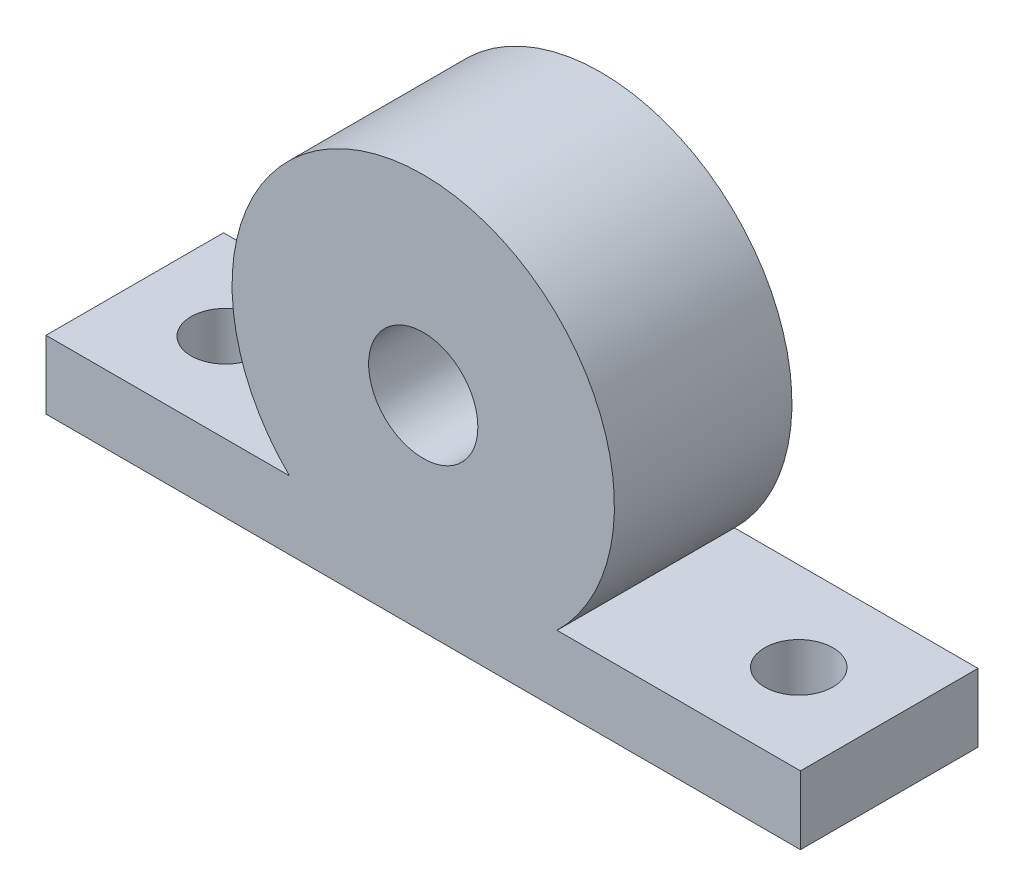
ISO-10303-21;
HEADER;
FILE_DESCRIPTION(('STEP AP214'),'2;1');
FILE_NAME('part.step','',(''),(''),'','','');
FILE_SCHEMA(('AUTOMOTIVE_DESIGN { 1 0 10303 214 1 1 1 1 }'));
ENDSEC;
DATA;
#1=APPLICATION_CONTEXT('core data for automotive mechanical design processes');
#2=APPLICATION_PROTOCOL_DEFINITION('international standard','automotive_design',2000,#1);
#3=PRODUCT_CONTEXT('',#1,'mechanical');
#4=PRODUCT('Part','Part','',(#3));
#5=PRODUCT_RELATED_PRODUCT_CATEGORY('part','',(#4));
#6=PRODUCT_DEFINITION_FORMATION('','',#4);
#7=PRODUCT_DEFINITION_CONTEXT('part definition',#1,'design');
#8=PRODUCT_DEFINITION('design','',#6,#7);
#9=PRODUCT_DEFINITION_SHAPE('','',#8);
#10=(LENGTH_UNIT() NAMED_UNIT(*) SI_UNIT(.MILLI.,.METRE.));
#11=(NAMED_UNIT(*) PLANE_ANGLE_UNIT() SI_UNIT($,.RADIAN.));
#12=(NAMED_UNIT(*) SI_UNIT($,.STERADIAN.) SOLID_ANGLE_UNIT());
#13=UNCERTAINTY_MEASURE_WITH_UNIT(LENGTH_MEASURE(1.E-05),#10,'distance_accuracy_value','');
#14=(GEOMETRIC_REPRESENTATION_CONTEXT(3) GLOBAL_UNCERTAINTY_ASSIGNED_CONTEXT((#13)) GLOBAL_UNIT_ASSIGNED_CONTEXT((#10,
#11,#12)) REPRESENTATION_CONTEXT('',''));
#15=CARTESIAN_POINT('',(0.,0.,0.));
#16=DIRECTION('',(0.,0.,1.));
#17=DIRECTION('',(1.,0.,0.));
#18=AXIS2_PLACEMENT_3D('',#15,#16,#17);
#19=CARTESIAN_POINT('',(0.,0.,13.));
#20=DIRECTION('',(0.,0.,1.));
#21=DIRECTION('',(1.,0.,0.));
#22=AXIS2_PLACEMENT_3D('',#19,#20,#21);
#23=PLANE('',#22);
#24=DIRECTION('',(0.,-1.,0.));
#25=VECTOR('',#24,1.);
#26=CARTESIAN_POINT('',(-27.625,-15.,13.));
#27=LINE('',#26,#25);
#28=CARTESIAN_POINT('',(-27.625,-10.,13.));
#29=VERTEX_POINT('',#28);
#30=CARTESIAN_POINT('',(-27.625,-15.,13.));
#31=VERTEX_POINT('',#30);
#32=EDGE_CURVE('E131',#29,#31,#27,.T.);
#33=ORIENTED_EDGE('',*,*,#32,.T.);
#34=DIRECTION('',(1.,0.,0.));
#35=VECTOR('',#34,1.);
#36=CARTESIAN_POINT('',(-27.625,-15.,13.));
#37=LINE('',#36,#35);
#38=CARTESIAN_POINT('',(27.625,-15.,13.));
#39=VERTEX_POINT('',#38);
#40=EDGE_CURVE('E89',#31,#39,#37,.T.);
#41=ORIENTED_EDGE('',*,*,#40,.T.);
#42=DIRECTION('',(0.,1.,0.));
#43=VECTOR('',#42,1.);
#44=CARTESIAN_POINT('',(27.625,-9.99999999999999,13.));
#45=LINE('',#44,#43);
#46=CARTESIAN_POINT('',(27.625,-9.99999999999999,13.));
#47=VERTEX_POINT('',#46);
#48=EDGE_CURVE('E102',#39,#47,#45,.T.);
#49=ORIENTED_EDGE('',*,*,#48,.T.);
#50=DIRECTION('',(-1.,0.,0.));
#51=VECTOR('',#50,1.);
#52=CARTESIAN_POINT('',(9.79795897113272,-9.99999999999999,13.));
#53=LINE('',#52,#51);
#54=CARTESIAN_POINT('',(9.79795897113272,-9.99999999999999,13.));
#55=VERTEX_POINT('',#54);
#56=EDGE_CURVE('E96',#47,#55,#53,.T.);
#57=ORIENTED_EDGE('',*,*,#56,.T.);
#58=CARTESIAN_POINT('',(0.,0.,13.));
#59=DIRECTION('',(0.,0.,1.));
#60=DIRECTION('',(1.,0.,0.));
#61=AXIS2_PLACEMENT_3D('',#58,#59,#60);
#62=CIRCLE('',#61,14.);
#63=CARTESIAN_POINT('',(-9.79795897113272,-9.99999999999999,13.));
#64=VERTEX_POINT('',#63);
#65=EDGE_CURVE('E100',#55,#64,#62,.T.);
#66=ORIENTED_EDGE('',*,*,#65,.T.);
#67=DIRECTION('',(-1.,0.,0.));
#68=VECTOR('',#67,1.);
#69=CARTESIAN_POINT('',(-27.625,-10.,13.));
#70=LINE('',#69,#68);
#71=EDGE_CURVE('E52',#64,#29,#70,.T.);
#72=ORIENTED_EDGE('',*,*,#71,.T.);
#73=EDGE_LOOP('',(#33,#41,#49,#57,#66,#72));
#74=FACE_BOUND('',#73,.T.);
#75=CARTESIAN_POINT('',(0.,0.,13.));
#76=DIRECTION('',(0.,0.,1.));
#77=DIRECTION('',(1.,0.,0.));
#78=AXIS2_PLACEMENT_3D('',#75,#76,#77);
#79=CIRCLE('',#78,4.);
#80=CARTESIAN_POINT('',(4.,0.,13.));
#81=VERTEX_POINT('',#80);
#82=EDGE_CURVE('E124',#81,#81,#79,.T.);
#83=ORIENTED_EDGE('',*,*,#82,.F.);
#84=EDGE_LOOP('',(#83));
#85=FACE_BOUND('',#84,.T.);
#86=ADVANCED_FACE('F33',(#74,#85),#23,.T.);
#87=CARTESIAN_POINT('',(0.,0.,0.));
#88=DIRECTION('',(0.,0.,1.));
#89=DIRECTION('',(1.,0.,0.));
#90=AXIS2_PLACEMENT_3D('',#87,#88,#89);
#91=PLANE('',#90);
#92=DIRECTION('',(0.,-1.,0.));
#93=VECTOR('',#92,1.);
#94=CARTESIAN_POINT('',(-27.625,-15.,0.));
#95=LINE('',#94,#93);
#96=CARTESIAN_POINT('',(-27.625,-10.,0.));
#97=VERTEX_POINT('',#96);
#98=CARTESIAN_POINT('',(-27.625,-15.,0.));
#99=VERTEX_POINT('',#98);
#100=EDGE_CURVE('E120',#97,#99,#95,.T.);
#101=ORIENTED_EDGE('',*,*,#100,.F.);
#102=DIRECTION('',(-1.,0.,0.));
#103=VECTOR('',#102,1.);
#104=CARTESIAN_POINT('',(-27.625,-10.,0.));
#105=LINE('',#104,#103);
#106=CARTESIAN_POINT('',(-9.79795897113272,-9.99999999999999,0.));
#107=VERTEX_POINT('',#106);
#108=EDGE_CURVE('E81',#107,#97,#105,.T.);
#109=ORIENTED_EDGE('',*,*,#108,.F.);
#110=CARTESIAN_POINT('',(0.,0.,0.));
#111=DIRECTION('',(0.,0.,1.));
#112=DIRECTION('',(1.,0.,0.));
#113=AXIS2_PLACEMENT_3D('',#110,#111,#112);
#114=CIRCLE('',#113,14.);
#115=CARTESIAN_POINT('',(9.79795897113272,-9.99999999999999,0.));
#116=VERTEX_POINT('',#115);
#117=EDGE_CURVE('E75',#116,#107,#114,.T.);
#118=ORIENTED_EDGE('',*,*,#117,.F.);
#119=DIRECTION('',(-1.,0.,0.));
#120=VECTOR('',#119,1.);
#121=CARTESIAN_POINT('',(9.79795897113272,-9.99999999999999,0.));
#122=LINE('',#121,#120);
#123=CARTESIAN_POINT('',(27.625,-9.99999999999999,0.));
#124=VERTEX_POINT('',#123);
#125=EDGE_CURVE('E110',#124,#116,#122,.T.);
#126=ORIENTED_EDGE('',*,*,#125,.F.);
#127=DIRECTION('',(0.,1.,0.));
#128=VECTOR('',#127,1.);
#129=CARTESIAN_POINT('',(27.625,-9.99999999999999,0.));
#130=LINE('',#129,#128);
#131=CARTESIAN_POINT('',(27.625,-15.,0.));
#132=VERTEX_POINT('',#131);
#133=EDGE_CURVE('E126',#132,#124,#130,.T.);
#134=ORIENTED_EDGE('',*,*,#133,.F.);
#135=DIRECTION('',(1.,0.,0.));
#136=VECTOR('',#135,1.);
#137=CARTESIAN_POINT('',(-27.625,-15.,0.));
#138=LINE('',#137,#136);
#139=EDGE_CURVE('E123',#99,#132,#138,.T.);
#140=ORIENTED_EDGE('',*,*,#139,.F.);
#141=EDGE_LOOP('',(#101,#109,#118,#126,#134,#140));
#142=FACE_BOUND('',#141,.T.);
#143=CARTESIAN_POINT('',(0.,0.,0.));
#144=DIRECTION('',(0.,0.,1.));
#145=DIRECTION('',(1.,0.,0.));
#146=AXIS2_PLACEMENT_3D('',#143,#144,#145);
#147=CIRCLE('',#146,4.);
#148=CARTESIAN_POINT('',(4.,0.,0.));
#149=VERTEX_POINT('',#148);
#150=EDGE_CURVE('E138',#149,#149,#147,.T.);
#151=ORIENTED_EDGE('',*,*,#150,.T.);
#152=EDGE_LOOP('',(#151));
#153=FACE_BOUND('',#152,.T.);
#154=ADVANCED_FACE('F163',(#142,#153),#91,.F.);
#155=CARTESIAN_POINT('',(-27.625,-15.,13.));
#156=DIRECTION('',(1.,0.,0.));
#157=DIRECTION('',(0.,0.,-1.));
#158=AXIS2_PLACEMENT_3D('',#155,#156,#157);
#159=PLANE('',#158);
#160=ORIENTED_EDGE('',*,*,#100,.T.);
#161=DIRECTION('',(0.,0.,-1.));
#162=VECTOR('',#161,1.);
#163=CARTESIAN_POINT('',(-27.625,-15.,13.));
#164=LINE('',#163,#162);
#165=EDGE_CURVE('E11',#31,#99,#164,.T.);
#166=ORIENTED_EDGE('',*,*,#165,.F.);
#167=ORIENTED_EDGE('',*,*,#32,.F.);
#168=DIRECTION('',(0.,0.,-1.));
#169=VECTOR('',#168,1.);
#170=CARTESIAN_POINT('',(-27.625,-10.,13.));
#171=LINE('',#170,#169);
#172=EDGE_CURVE('E116',#29,#97,#171,.T.);
#173=ORIENTED_EDGE('',*,*,#172,.T.);
#174=EDGE_LOOP('',(#160,#166,#167,#173));
#175=FACE_BOUND('',#174,.T.);
#176=ADVANCED_FACE('F35',(#175),#159,.F.);
#177=CARTESIAN_POINT('',(-27.625,-15.,13.));
#178=DIRECTION('',(0.,1.,0.));
#179=DIRECTION('',(-1.,0.,0.));
#180=AXIS2_PLACEMENT_3D('',#177,#178,#179);
#181=PLANE('',#180);
#182=CARTESIAN_POINT('',(21.,-15.,6.5));
#183=DIRECTION('',(0.,-1.,0.));
#184=DIRECTION('',(1.,0.,0.));
#185=AXIS2_PLACEMENT_3D('',#182,#183,#184);
#186=CIRCLE('',#185,2.5);
#187=CARTESIAN_POINT('',(23.5,-15.,6.5));
#188=VERTEX_POINT('',#187);
#189=EDGE_CURVE('E149',#188,#188,#186,.T.);
#190=ORIENTED_EDGE('',*,*,#189,.F.);
#191=EDGE_LOOP('',(#190));
#192=FACE_BOUND('',#191,.T.);
#193=CARTESIAN_POINT('',(-21.,-15.,6.5));
#194=DIRECTION('',(0.,-1.,0.));
#195=DIRECTION('',(1.,0.,0.));
#196=AXIS2_PLACEMENT_3D('',#193,#194,#195);
#197=CIRCLE('',#196,2.5);
#198=CARTESIAN_POINT('',(-18.5,-15.,6.5));
#199=VERTEX_POINT('',#198);
#200=EDGE_CURVE('E139',#199,#199,#197,.T.);
#201=ORIENTED_EDGE('',*,*,#200,.F.);
#202=EDGE_LOOP('',(#201));
#203=FACE_BOUND('',#202,.T.);
#204=ORIENTED_EDGE('',*,*,#139,.T.);
#205=DIRECTION('',(0.,0.,-1.));
#206=VECTOR('',#205,1.);
#207=CARTESIAN_POINT('',(27.625,-15.,13.));
#208=LINE('',#207,#206);
#209=EDGE_CURVE('E43',#39,#132,#208,.T.);
#210=ORIENTED_EDGE('',*,*,#209,.F.);
#211=ORIENTED_EDGE('',*,*,#40,.F.);
#212=ORIENTED_EDGE('',*,*,#165,.T.);
#213=EDGE_LOOP('',(#204,#210,#211,#212));
#214=FACE_BOUND('',#213,.T.);
#215=ADVANCED_FACE('F157',(#192,#203,#214),#181,.F.);
#216=CARTESIAN_POINT('',(27.625,-9.99999999999999,13.));
#217=DIRECTION('',(-1.,0.,0.));
#218=DIRECTION('',(0.,-1.,0.));
#219=AXIS2_PLACEMENT_3D('',#216,#217,#218);
#220=PLANE('',#219);
#221=ORIENTED_EDGE('',*,*,#133,.T.);
#222=DIRECTION('',(0.,0.,-1.));
#223=VECTOR('',#222,1.);
#224=CARTESIAN_POINT('',(27.625,-9.99999999999999,13.));
#225=LINE('',#224,#223);
#226=EDGE_CURVE('E111',#47,#124,#225,.T.);
#227=ORIENTED_EDGE('',*,*,#226,.F.);
#228=ORIENTED_EDGE('',*,*,#48,.F.);
#229=ORIENTED_EDGE('',*,*,#209,.T.);
#230=EDGE_LOOP('',(#221,#227,#228,#229));
#231=FACE_BOUND('',#230,.T.);
#232=ADVANCED_FACE('F160',(#231),#220,.F.);
#233=CARTESIAN_POINT('',(9.79795897113272,-9.99999999999999,13.));
#234=DIRECTION('',(0.,-1.,0.));
#235=DIRECTION('',(1.,0.,0.));
#236=AXIS2_PLACEMENT_3D('',#233,#234,#235);
#237=PLANE('',#236);
#238=CARTESIAN_POINT('',(21.,-9.99999999999999,6.5));
#239=DIRECTION('',(0.,-1.,0.));
#240=DIRECTION('',(1.,0.,0.));
#241=AXIS2_PLACEMENT_3D('',#238,#239,#240);
#242=CIRCLE('',#241,2.5);
#243=CARTESIAN_POINT('',(23.5,-9.99999999999999,6.5));
#244=VERTEX_POINT('',#243);
#245=EDGE_CURVE('E37',#244,#244,#242,.T.);
#246=ORIENTED_EDGE('',*,*,#245,.T.);
#247=EDGE_LOOP('',(#246));
#248=FACE_BOUND('',#247,.T.);
#249=ORIENTED_EDGE('',*,*,#125,.T.);
#250=DIRECTION('',(0.,0.,-1.));
#251=VECTOR('',#250,1.);
#252=CARTESIAN_POINT('',(9.79795897113272,-9.99999999999999,13.));
#253=LINE('',#252,#251);
#254=EDGE_CURVE('E107',#55,#116,#253,.T.);
#255=ORIENTED_EDGE('',*,*,#254,.F.);
#256=ORIENTED_EDGE('',*,*,#56,.F.);
#257=ORIENTED_EDGE('',*,*,#226,.T.);
#258=EDGE_LOOP('',(#249,#255,#256,#257));
#259=FACE_BOUND('',#258,.T.);
#260=ADVANCED_FACE('F108',(#248,#259),#237,.F.);
#261=CARTESIAN_POINT('',(0.,0.,13.));
#262=DIRECTION('',(0.,0.,-1.));
#263=DIRECTION('',(-1.,0.,0.));
#264=AXIS2_PLACEMENT_3D('',#261,#262,#263);
#265=CYLINDRICAL_SURFACE('',#264,14.);
#266=ORIENTED_EDGE('',*,*,#117,.T.);
#267=DIRECTION('',(0.,0.,-1.));
#268=VECTOR('',#267,1.);
#269=CARTESIAN_POINT('',(-9.79795897113272,-9.99999999999999,13.));
#270=LINE('',#269,#268);
#271=EDGE_CURVE('E112',#64,#107,#270,.T.);
#272=ORIENTED_EDGE('',*,*,#271,.F.);
#273=ORIENTED_EDGE('',*,*,#65,.F.);
#274=ORIENTED_EDGE('',*,*,#254,.T.);
#275=EDGE_LOOP('',(#266,#272,#273,#274));
#276=FACE_BOUND('',#275,.T.);
#277=ADVANCED_FACE('F114',(#276),#265,.T.);
#278=CARTESIAN_POINT('',(-27.625,-10.,13.));
#279=DIRECTION('',(0.,-1.,0.));
#280=DIRECTION('',(1.,0.,0.));
#281=AXIS2_PLACEMENT_3D('',#278,#279,#280);
#282=PLANE('',#281);
#283=CARTESIAN_POINT('',(-21.,-10.,6.5));
#284=DIRECTION('',(0.,-1.,0.));
#285=DIRECTION('',(1.,0.,0.));
#286=AXIS2_PLACEMENT_3D('',#283,#284,#285);
#287=CIRCLE('',#286,2.5);
#288=CARTESIAN_POINT('',(-18.5,-10.,6.5));
#289=VERTEX_POINT('',#288);
#290=EDGE_CURVE('E136',#289,#289,#287,.T.);
#291=ORIENTED_EDGE('',*,*,#290,.T.);
#292=EDGE_LOOP('',(#291));
#293=FACE_BOUND('',#292,.T.);
#294=ORIENTED_EDGE('',*,*,#108,.T.);
#295=ORIENTED_EDGE('',*,*,#172,.F.);
#296=ORIENTED_EDGE('',*,*,#71,.F.);
#297=ORIENTED_EDGE('',*,*,#271,.T.);
#298=EDGE_LOOP('',(#294,#295,#296,#297));
#299=FACE_BOUND('',#298,.T.);
#300=ADVANCED_FACE('F166',(#293,#299),#282,.F.);
#301=CARTESIAN_POINT('',(0.,0.,13.));
#302=DIRECTION('',(0.,0.,-1.));
#303=DIRECTION('',(-1.,0.,0.));
#304=AXIS2_PLACEMENT_3D('',#301,#302,#303);
#305=CYLINDRICAL_SURFACE('',#304,4.);
#306=ORIENTED_EDGE('',*,*,#82,.T.);
#307=EDGE_LOOP('',(#306));
#308=FACE_BOUND('',#307,.T.);
#309=ORIENTED_EDGE('',*,*,#150,.F.);
#310=EDGE_LOOP('',(#309));
#311=FACE_BOUND('',#310,.T.);
#312=ADVANCED_FACE('F168',(#308,#311),#305,.F.);
#313=CARTESIAN_POINT('',(-21.,14.,6.5));
#314=DIRECTION('',(0.,-1.,0.));
#315=DIRECTION('',(1.,0.,0.));
#316=AXIS2_PLACEMENT_3D('',#313,#314,#315);
#317=CYLINDRICAL_SURFACE('',#316,2.5);
#318=ORIENTED_EDGE('',*,*,#200,.T.);
#319=EDGE_LOOP('',(#318));
#320=FACE_BOUND('',#319,.T.);
#321=ORIENTED_EDGE('',*,*,#290,.F.);
#322=EDGE_LOOP('',(#321));
#323=FACE_BOUND('',#322,.T.);
#324=ADVANCED_FACE('F174',(#320,#323),#317,.F.);
#325=CARTESIAN_POINT('',(21.,14.,6.5));
#326=DIRECTION('',(0.,-1.,0.));
#327=DIRECTION('',(1.,0.,0.));
#328=AXIS2_PLACEMENT_3D('',#325,#326,#327);
#329=CYLINDRICAL_SURFACE('',#328,2.5);
#330=ORIENTED_EDGE('',*,*,#189,.T.);
#331=EDGE_LOOP('',(#330));
#332=FACE_BOUND('',#331,.T.);
#333=ORIENTED_EDGE('',*,*,#245,.F.);
#334=EDGE_LOOP('',(#333));
#335=FACE_BOUND('',#334,.T.);
#336=ADVANCED_FACE('F187',(#332,#335),#329,.F.);
#337=CLOSED_SHELL('',(#86,#154,#176,#215,#232,#260,#277,#300,#312,#324,#336));
#338=MANIFOLD_SOLID_BREP('B2',#337);
#339=ADVANCED_BREP_SHAPE_REPRESENTATION('',(#18,#338),#14);
#340=SHAPE_DEFINITION_REPRESENTATION(#9,#339);
ENDSEC;
END-ISO-10303-21;
